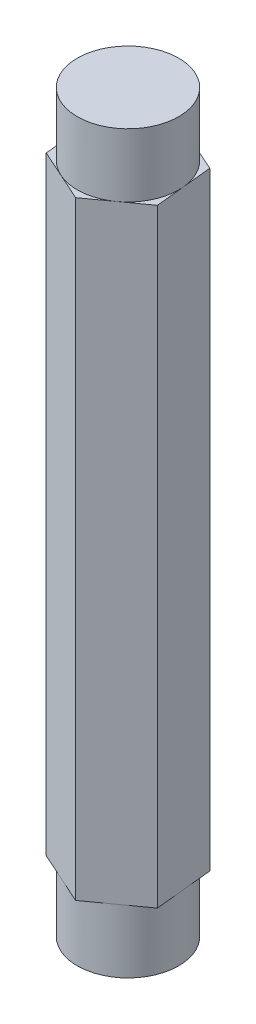
ISO-10303-21;
HEADER;
FILE_DESCRIPTION(('STEP AP214'),'2;1');
FILE_NAME('part.step','',(''),(''),'','','');
FILE_SCHEMA(('AUTOMOTIVE_DESIGN { 1 0 10303 214 1 1 1 1 }'));
ENDSEC;
DATA;
#1=APPLICATION_CONTEXT('core data for automotive mechanical design processes');
#2=APPLICATION_PROTOCOL_DEFINITION('international standard','automotive_design',2000,#1);
#3=PRODUCT_CONTEXT('',#1,'mechanical');
#4=PRODUCT('Part','Part','',(#3));
#5=PRODUCT_RELATED_PRODUCT_CATEGORY('part','',(#4));
#6=PRODUCT_DEFINITION_FORMATION('','',#4);
#7=PRODUCT_DEFINITION_CONTEXT('part definition',#1,'design');
#8=PRODUCT_DEFINITION('design','',#6,#7);
#9=PRODUCT_DEFINITION_SHAPE('','',#8);
#10=(LENGTH_UNIT() NAMED_UNIT(*) SI_UNIT(.MILLI.,.METRE.));
#11=(NAMED_UNIT(*) PLANE_ANGLE_UNIT() SI_UNIT($,.RADIAN.));
#12=(NAMED_UNIT(*) SI_UNIT($,.STERADIAN.) SOLID_ANGLE_UNIT());
#13=UNCERTAINTY_MEASURE_WITH_UNIT(LENGTH_MEASURE(1.E-05),#10,'distance_accuracy_value','');
#14=(GEOMETRIC_REPRESENTATION_CONTEXT(3) GLOBAL_UNCERTAINTY_ASSIGNED_CONTEXT((#13)) GLOBAL_UNIT_ASSIGNED_CONTEXT((#10,
#11,#12)) REPRESENTATION_CONTEXT('',''));
#15=CARTESIAN_POINT('',(0.,0.,0.));
#16=DIRECTION('',(0.,0.,1.));
#17=DIRECTION('',(1.,0.,0.));
#18=AXIS2_PLACEMENT_3D('',#15,#16,#17);
#19=CARTESIAN_POINT('',(0.,76.2,0.));
#20=DIRECTION('',(0.,1.,0.));
#21=DIRECTION('',(0.,0.,1.));
#22=AXIS2_PLACEMENT_3D('',#19,#20,#21);
#23=PLANE('',#22);
#24=CARTESIAN_POINT('',(0.,76.2,0.));
#25=DIRECTION('',(0.,1.,0.));
#26=DIRECTION('',(0.,0.,1.));
#27=AXIS2_PLACEMENT_3D('',#24,#25,#26);
#28=CIRCLE('',#27,6.35);
#29=CARTESIAN_POINT('',(3.71233056457002,76.2,5.15180568144406));
#30=VERTEX_POINT('',#29);
#31=CARTESIAN_POINT('',(6.31775987777654,76.2,-0.639069735441033));
#32=VERTEX_POINT('',#31);
#33=EDGE_CURVE('E44',#30,#32,#28,.T.);
#34=ORIENTED_EDGE('',*,*,#33,.F.);
#35=DIRECTION('',(0.811307981329773,0.,-0.584618986546459));
#36=VECTOR('',#35,1.);
#37=CARTESIAN_POINT('',(0.737934167575647,76.2,7.29512073221941));
#38=LINE('',#37,#36);
#39=CARTESIAN_POINT('',(6.68672696156437,76.2,3.00849063066868));
#40=VERTEX_POINT('',#39);
#41=EDGE_CURVE('E132',#30,#40,#38,.T.);
#42=ORIENTED_EDGE('',*,*,#41,.T.);
#43=DIRECTION('',(-0.100640903219061,0.,-0.994922815397884));
#44=VECTOR('',#43,1.);
#45=CARTESIAN_POINT('',(6.68672696156437,76.2,3.00849063066868));
#46=LINE('',#45,#44);
#47=EDGE_CURVE('E144',#40,#32,#46,.T.);
#48=ORIENTED_EDGE('',*,*,#47,.T.);
#49=EDGE_LOOP('',(#34,#42,#48));
#50=FACE_BOUND('',#49,.T.);
#51=ADVANCED_FACE('F33',(#50),#23,.T.);
#52=CARTESIAN_POINT('',(2.60542931320654,76.2,-5.79087541688507));
#53=VERTEX_POINT('',#52);
#54=EDGE_CURVE('E11',#32,#53,#28,.T.);
#55=ORIENTED_EDGE('',*,*,#54,.F.);
#56=CARTESIAN_POINT('',(5.94879279398872,76.2,-4.28663010155074));
#57=VERTEX_POINT('',#56);
#58=EDGE_CURVE('E165',#32,#57,#46,.T.);
#59=ORIENTED_EDGE('',*,*,#58,.T.);
#60=DIRECTION('',(-0.911948884548833,0.,-0.410303828851424));
#61=VECTOR('',#60,1.);
#62=CARTESIAN_POINT('',(5.94879279398872,76.2,-4.28663010155074));
#63=LINE('',#62,#61);
#64=EDGE_CURVE('E166',#57,#53,#63,.T.);
#65=ORIENTED_EDGE('',*,*,#64,.T.);
#66=EDGE_LOOP('',(#55,#59,#65));
#67=FACE_BOUND('',#66,.T.);
#68=ADVANCED_FACE('F261',(#67),#23,.T.);
#69=CARTESIAN_POINT('',(-3.71233056457001,76.2,-5.15180568144404));
#70=VERTEX_POINT('',#69);
#71=EDGE_CURVE('E42',#53,#70,#28,.T.);
#72=ORIENTED_EDGE('',*,*,#71,.F.);
#73=CARTESIAN_POINT('',(-0.737934167575646,76.2,-7.29512073221941));
#74=VERTEX_POINT('',#73);
#75=EDGE_CURVE('E164',#53,#74,#63,.T.);
#76=ORIENTED_EDGE('',*,*,#75,.T.);
#77=DIRECTION('',(-0.811307981329773,0.,0.584618986546459));
#78=VECTOR('',#77,1.);
#79=CARTESIAN_POINT('',(-0.737934167575646,76.2,-7.29512073221941));
#80=LINE('',#79,#78);
#81=EDGE_CURVE('E170',#74,#70,#80,.T.);
#82=ORIENTED_EDGE('',*,*,#81,.T.);
#83=EDGE_LOOP('',(#72,#76,#82));
#84=FACE_BOUND('',#83,.T.);
#85=ADVANCED_FACE('F265',(#84),#23,.T.);
#86=CARTESIAN_POINT('',(-6.31775987777654,76.2,0.639069735441035));
#87=VERTEX_POINT('',#86);
#88=EDGE_CURVE('E150',#70,#87,#28,.T.);
#89=ORIENTED_EDGE('',*,*,#88,.F.);
#90=CARTESIAN_POINT('',(-6.68672696156436,76.2,-3.00849063066868));
#91=VERTEX_POINT('',#90);
#92=EDGE_CURVE('E169',#70,#91,#80,.T.);
#93=ORIENTED_EDGE('',*,*,#92,.T.);
#94=DIRECTION('',(0.100640903219061,0.,0.994922815397884));
#95=VECTOR('',#94,1.);
#96=CARTESIAN_POINT('',(-6.68672696156436,76.2,-3.00849063066868));
#97=LINE('',#96,#95);
#98=EDGE_CURVE('E174',#91,#87,#97,.T.);
#99=ORIENTED_EDGE('',*,*,#98,.T.);
#100=EDGE_LOOP('',(#89,#93,#99));
#101=FACE_BOUND('',#100,.T.);
#102=ADVANCED_FACE('F269',(#101),#23,.T.);
#103=CARTESIAN_POINT('',(-2.60542931320654,76.2,5.79087541688508));
#104=VERTEX_POINT('',#103);
#105=EDGE_CURVE('E59',#87,#104,#28,.T.);
#106=ORIENTED_EDGE('',*,*,#105,.F.);
#107=CARTESIAN_POINT('',(-5.94879279398871,76.2,4.28663010155075));
#108=VERTEX_POINT('',#107);
#109=EDGE_CURVE('E173',#87,#108,#97,.T.);
#110=ORIENTED_EDGE('',*,*,#109,.T.);
#111=DIRECTION('',(0.911948884548833,0.,0.410303828851424));
#112=VECTOR('',#111,1.);
#113=CARTESIAN_POINT('',(-5.94879279398871,76.2,4.28663010155075));
#114=LINE('',#113,#112);
#115=EDGE_CURVE('E142',#108,#104,#114,.T.);
#116=ORIENTED_EDGE('',*,*,#115,.T.);
#117=EDGE_LOOP('',(#106,#110,#116));
#118=FACE_BOUND('',#117,.T.);
#119=ADVANCED_FACE('F270',(#118),#23,.T.);
#120=CARTESIAN_POINT('',(0.,0.,0.));
#121=DIRECTION('',(0.,1.,0.));
#122=DIRECTION('',(0.,0.,1.));
#123=AXIS2_PLACEMENT_3D('',#120,#121,#122);
#124=PLANE('',#123);
#125=CARTESIAN_POINT('',(0.,0.,0.));
#126=DIRECTION('',(0.,-1.,0.));
#127=DIRECTION('',(0.,0.,-1.));
#128=AXIS2_PLACEMENT_3D('',#125,#126,#127);
#129=CIRCLE('',#128,6.35);
#130=CARTESIAN_POINT('',(2.60542931320655,0.,-5.79087541688509));
#131=VERTEX_POINT('',#130);
#132=CARTESIAN_POINT('',(6.31775987777654,0.,-0.639069735441033));
#133=VERTEX_POINT('',#132);
#134=EDGE_CURVE('E154',#131,#133,#129,.T.);
#135=ORIENTED_EDGE('',*,*,#134,.F.);
#136=DIRECTION('',(-0.911948884548833,0.,-0.410303828851424));
#137=VECTOR('',#136,1.);
#138=CARTESIAN_POINT('',(5.94879279398872,0.,-4.28663010155074));
#139=LINE('',#138,#137);
#140=CARTESIAN_POINT('',(5.94879279398872,0.,-4.28663010155074));
#141=VERTEX_POINT('',#140);
#142=EDGE_CURVE('E182',#141,#131,#139,.T.);
#143=ORIENTED_EDGE('',*,*,#142,.F.);
#144=DIRECTION('',(-0.100640903219061,0.,-0.994922815397884));
#145=VECTOR('',#144,1.);
#146=CARTESIAN_POINT('',(6.68672696156437,0.,3.00849063066868));
#147=LINE('',#146,#145);
#148=EDGE_CURVE('E159',#133,#141,#147,.T.);
#149=ORIENTED_EDGE('',*,*,#148,.F.);
#150=EDGE_LOOP('',(#135,#143,#149));
#151=FACE_BOUND('',#150,.T.);
#152=ADVANCED_FACE('F257',(#151),#124,.F.);
#153=CARTESIAN_POINT('',(3.71233056457001,0.,5.15180568144405));
#154=VERTEX_POINT('',#153);
#155=EDGE_CURVE('E149',#133,#154,#129,.T.);
#156=ORIENTED_EDGE('',*,*,#155,.F.);
#157=CARTESIAN_POINT('',(6.68672696156437,0.,3.00849063066868));
#158=VERTEX_POINT('',#157);
#159=EDGE_CURVE('E178',#158,#133,#147,.T.);
#160=ORIENTED_EDGE('',*,*,#159,.F.);
#161=DIRECTION('',(0.811307981329773,0.,-0.584618986546459));
#162=VECTOR('',#161,1.);
#163=CARTESIAN_POINT('',(0.737934167575647,0.,7.29512073221941));
#164=LINE('',#163,#162);
#165=EDGE_CURVE('E196',#154,#158,#164,.T.);
#166=ORIENTED_EDGE('',*,*,#165,.F.);
#167=EDGE_LOOP('',(#156,#160,#166));
#168=FACE_BOUND('',#167,.T.);
#169=ADVANCED_FACE('F232',(#168),#124,.F.);
#170=CARTESIAN_POINT('',(-2.60542931320654,0.,5.79087541688508));
#171=VERTEX_POINT('',#170);
#172=EDGE_CURVE('E152',#154,#171,#129,.T.);
#173=ORIENTED_EDGE('',*,*,#172,.F.);
#174=CARTESIAN_POINT('',(0.737934167575647,0.,7.29512073221941));
#175=VERTEX_POINT('',#174);
#176=EDGE_CURVE('E197',#175,#154,#164,.T.);
#177=ORIENTED_EDGE('',*,*,#176,.F.);
#178=DIRECTION('',(0.911948884548833,0.,0.410303828851424));
#179=VECTOR('',#178,1.);
#180=CARTESIAN_POINT('',(-5.94879279398871,0.,4.28663010155075));
#181=LINE('',#180,#179);
#182=EDGE_CURVE('E192',#171,#175,#181,.T.);
#183=ORIENTED_EDGE('',*,*,#182,.F.);
#184=EDGE_LOOP('',(#173,#177,#183));
#185=FACE_BOUND('',#184,.T.);
#186=ADVANCED_FACE('F229',(#185),#124,.F.);
#187=CARTESIAN_POINT('',(-6.31775987777654,0.,0.639069735441035));
#188=VERTEX_POINT('',#187);
#189=EDGE_CURVE('E221',#171,#188,#129,.T.);
#190=ORIENTED_EDGE('',*,*,#189,.F.);
#191=CARTESIAN_POINT('',(-5.94879279398871,0.,4.28663010155075));
#192=VERTEX_POINT('',#191);
#193=EDGE_CURVE('E193',#192,#171,#181,.T.);
#194=ORIENTED_EDGE('',*,*,#193,.F.);
#195=DIRECTION('',(0.100640903219061,0.,0.994922815397884));
#196=VECTOR('',#195,1.);
#197=CARTESIAN_POINT('',(-6.68672696156436,0.,-3.00849063066868));
#198=LINE('',#197,#196);
#199=EDGE_CURVE('E188',#188,#192,#198,.T.);
#200=ORIENTED_EDGE('',*,*,#199,.F.);
#201=EDGE_LOOP('',(#190,#194,#200));
#202=FACE_BOUND('',#201,.T.);
#203=ADVANCED_FACE('F241',(#202),#124,.F.);
#204=CARTESIAN_POINT('',(-3.71233056457001,0.,-5.15180568144404));
#205=VERTEX_POINT('',#204);
#206=EDGE_CURVE('E218',#188,#205,#129,.T.);
#207=ORIENTED_EDGE('',*,*,#206,.F.);
#208=CARTESIAN_POINT('',(-6.68672696156436,0.,-3.00849063066868));
#209=VERTEX_POINT('',#208);
#210=EDGE_CURVE('E189',#209,#188,#198,.T.);
#211=ORIENTED_EDGE('',*,*,#210,.F.);
#212=DIRECTION('',(-0.811307981329773,0.,0.584618986546459));
#213=VECTOR('',#212,1.);
#214=CARTESIAN_POINT('',(-0.737934167575646,0.,-7.29512073221941));
#215=LINE('',#214,#213);
#216=EDGE_CURVE('E184',#205,#209,#215,.T.);
#217=ORIENTED_EDGE('',*,*,#216,.F.);
#218=EDGE_LOOP('',(#207,#211,#217));
#219=FACE_BOUND('',#218,.T.);
#220=ADVANCED_FACE('F249',(#219),#124,.F.);
#221=CARTESIAN_POINT('',(6.68672696156437,76.2,3.00849063066868));
#222=DIRECTION('',(-0.994922815397884,0.,0.100640903219061));
#223=DIRECTION('',(0.100640903219061,0.,0.994922815397884));
#224=AXIS2_PLACEMENT_3D('',#221,#222,#223);
#225=PLANE('',#224);
#226=ORIENTED_EDGE('',*,*,#159,.T.);
#227=ORIENTED_EDGE('',*,*,#148,.T.);
#228=DIRECTION('',(0.,-1.,0.));
#229=VECTOR('',#228,1.);
#230=CARTESIAN_POINT('',(5.94879279398872,76.2,-4.28663010155074));
#231=LINE('',#230,#229);
#232=EDGE_CURVE('E37',#57,#141,#231,.T.);
#233=ORIENTED_EDGE('',*,*,#232,.F.);
#234=ORIENTED_EDGE('',*,*,#58,.F.);
#235=ORIENTED_EDGE('',*,*,#47,.F.);
#236=DIRECTION('',(0.,-1.,0.));
#237=VECTOR('',#236,1.);
#238=CARTESIAN_POINT('',(6.68672696156437,76.2,3.00849063066868));
#239=LINE('',#238,#237);
#240=EDGE_CURVE('E131',#40,#158,#239,.T.);
#241=ORIENTED_EDGE('',*,*,#240,.T.);
#242=EDGE_LOOP('',(#226,#227,#233,#234,#235,#241));
#243=FACE_BOUND('',#242,.T.);
#244=ADVANCED_FACE('F35',(#243),#225,.F.);
#245=CARTESIAN_POINT('',(5.94879279398872,76.2,-4.28663010155074));
#246=DIRECTION('',(-0.410303828851425,0.,0.911948884548833));
#247=DIRECTION('',(0.911948884548833,0.,0.410303828851425));
#248=AXIS2_PLACEMENT_3D('',#245,#246,#247);
#249=PLANE('',#248);
#250=ORIENTED_EDGE('',*,*,#142,.T.);
#251=CARTESIAN_POINT('',(-0.737934167575646,0.,-7.29512073221941));
#252=VERTEX_POINT('',#251);
#253=EDGE_CURVE('E181',#131,#252,#139,.T.);
#254=ORIENTED_EDGE('',*,*,#253,.T.);
#255=DIRECTION('',(0.,-1.,0.));
#256=VECTOR('',#255,1.);
#257=CARTESIAN_POINT('',(-0.737934167575646,76.2,-7.29512073221941));
#258=LINE('',#257,#256);
#259=EDGE_CURVE('E207',#74,#252,#258,.T.);
#260=ORIENTED_EDGE('',*,*,#259,.F.);
#261=ORIENTED_EDGE('',*,*,#75,.F.);
#262=ORIENTED_EDGE('',*,*,#64,.F.);
#263=ORIENTED_EDGE('',*,*,#232,.T.);
#264=EDGE_LOOP('',(#250,#254,#260,#261,#262,#263));
#265=FACE_BOUND('',#264,.T.);
#266=ADVANCED_FACE('F263',(#265),#249,.F.);
#267=CARTESIAN_POINT('',(-0.737934167575646,76.2,-7.29512073221941));
#268=DIRECTION('',(0.584618986546459,0.,0.811307981329773));
#269=DIRECTION('',(0.811307981329773,0.,-0.584618986546459));
#270=AXIS2_PLACEMENT_3D('',#267,#268,#269);
#271=PLANE('',#270);
#272=EDGE_CURVE('E185',#252,#205,#215,.T.);
#273=ORIENTED_EDGE('',*,*,#272,.T.);
#274=ORIENTED_EDGE('',*,*,#216,.T.);
#275=DIRECTION('',(0.,-1.,0.));
#276=VECTOR('',#275,1.);
#277=CARTESIAN_POINT('',(-6.68672696156436,76.2,-3.00849063066868));
#278=LINE('',#277,#276);
#279=EDGE_CURVE('E205',#91,#209,#278,.T.);
#280=ORIENTED_EDGE('',*,*,#279,.F.);
#281=ORIENTED_EDGE('',*,*,#92,.F.);
#282=ORIENTED_EDGE('',*,*,#81,.F.);
#283=ORIENTED_EDGE('',*,*,#259,.T.);
#284=EDGE_LOOP('',(#273,#274,#280,#281,#282,#283));
#285=FACE_BOUND('',#284,.T.);
#286=ADVANCED_FACE('F250',(#285),#271,.F.);
#287=CARTESIAN_POINT('',(-6.68672696156436,76.2,-3.00849063066868));
#288=DIRECTION('',(0.994922815397884,0.,-0.100640903219061));
#289=DIRECTION('',(-0.100640903219061,0.,-0.994922815397884));
#290=AXIS2_PLACEMENT_3D('',#287,#288,#289);
#291=PLANE('',#290);
#292=ORIENTED_EDGE('',*,*,#210,.T.);
#293=ORIENTED_EDGE('',*,*,#199,.T.);
#294=DIRECTION('',(0.,-1.,0.));
#295=VECTOR('',#294,1.);
#296=CARTESIAN_POINT('',(-5.94879279398871,76.2,4.28663010155075));
#297=LINE('',#296,#295);
#298=EDGE_CURVE('E202',#108,#192,#297,.T.);
#299=ORIENTED_EDGE('',*,*,#298,.F.);
#300=ORIENTED_EDGE('',*,*,#109,.F.);
#301=ORIENTED_EDGE('',*,*,#98,.F.);
#302=ORIENTED_EDGE('',*,*,#279,.T.);
#303=EDGE_LOOP('',(#292,#293,#299,#300,#301,#302));
#304=FACE_BOUND('',#303,.T.);
#305=ADVANCED_FACE('F244',(#304),#291,.F.);
#306=CARTESIAN_POINT('',(-5.94879279398871,76.2,4.28663010155075));
#307=DIRECTION('',(0.410303828851424,0.,-0.911948884548833));
#308=DIRECTION('',(-0.911948884548833,0.,-0.410303828851424));
#309=AXIS2_PLACEMENT_3D('',#306,#307,#308);
#310=PLANE('',#309);
#311=ORIENTED_EDGE('',*,*,#193,.T.);
#312=ORIENTED_EDGE('',*,*,#182,.T.);
#313=DIRECTION('',(0.,-1.,0.));
#314=VECTOR('',#313,1.);
#315=CARTESIAN_POINT('',(0.737934167575647,76.2,7.29512073221941));
#316=LINE('',#315,#314);
#317=CARTESIAN_POINT('',(0.737934167575647,76.2,7.29512073221941));
#318=VERTEX_POINT('',#317);
#319=EDGE_CURVE('E200',#318,#175,#316,.T.);
#320=ORIENTED_EDGE('',*,*,#319,.F.);
#321=EDGE_CURVE('E127',#104,#318,#114,.T.);
#322=ORIENTED_EDGE('',*,*,#321,.F.);
#323=ORIENTED_EDGE('',*,*,#115,.F.);
#324=ORIENTED_EDGE('',*,*,#298,.T.);
#325=EDGE_LOOP('',(#311,#312,#320,#322,#323,#324));
#326=FACE_BOUND('',#325,.T.);
#327=ADVANCED_FACE('F235',(#326),#310,.F.);
#328=CARTESIAN_POINT('',(0.737934167575647,76.2,7.29512073221941));
#329=DIRECTION('',(-0.584618986546459,0.,-0.811307981329773));
#330=DIRECTION('',(-0.811307981329773,0.,0.584618986546459));
#331=AXIS2_PLACEMENT_3D('',#328,#329,#330);
#332=PLANE('',#331);
#333=ORIENTED_EDGE('',*,*,#176,.T.);
#334=ORIENTED_EDGE('',*,*,#165,.T.);
#335=ORIENTED_EDGE('',*,*,#240,.F.);
#336=ORIENTED_EDGE('',*,*,#41,.F.);
#337=EDGE_CURVE('E124',#318,#30,#38,.T.);
#338=ORIENTED_EDGE('',*,*,#337,.F.);
#339=ORIENTED_EDGE('',*,*,#319,.T.);
#340=EDGE_LOOP('',(#333,#334,#335,#336,#338,#339));
#341=FACE_BOUND('',#340,.T.);
#342=ADVANCED_FACE('F137',(#341),#332,.F.);
#343=EDGE_CURVE('E51',#104,#30,#28,.T.);
#344=ORIENTED_EDGE('',*,*,#343,.F.);
#345=ORIENTED_EDGE('',*,*,#321,.T.);
#346=ORIENTED_EDGE('',*,*,#337,.T.);
#347=EDGE_LOOP('',(#344,#345,#346));
#348=FACE_BOUND('',#347,.T.);
#349=ADVANCED_FACE('F126',(#348),#23,.T.);
#350=EDGE_CURVE('E162',#205,#131,#129,.T.);
#351=ORIENTED_EDGE('',*,*,#350,.F.);
#352=ORIENTED_EDGE('',*,*,#272,.F.);
#353=ORIENTED_EDGE('',*,*,#253,.F.);
#354=EDGE_LOOP('',(#351,#352,#353));
#355=FACE_BOUND('',#354,.T.);
#356=ADVANCED_FACE('F253',(#355),#124,.F.);
#357=CARTESIAN_POINT('',(0.,-7.9375,0.));
#358=DIRECTION('',(0.,1.,0.));
#359=DIRECTION('',(0.,0.,1.));
#360=AXIS2_PLACEMENT_3D('',#357,#358,#359);
#361=CYLINDRICAL_SURFACE('',#360,6.35);
#362=CARTESIAN_POINT('',(0.,-7.9375,0.));
#363=DIRECTION('',(0.,-1.,0.));
#364=DIRECTION('',(0.,0.,-1.));
#365=AXIS2_PLACEMENT_3D('',#362,#363,#364);
#366=CIRCLE('',#365,6.35);
#367=CARTESIAN_POINT('',(0.,-7.9375,-6.35));
#368=VERTEX_POINT('',#367);
#369=EDGE_CURVE('E157',#368,#368,#366,.T.);
#370=ORIENTED_EDGE('',*,*,#369,.F.);
#371=EDGE_LOOP('',(#370));
#372=FACE_BOUND('',#371,.T.);
#373=ORIENTED_EDGE('',*,*,#134,.T.);
#374=ORIENTED_EDGE('',*,*,#155,.T.);
#375=ORIENTED_EDGE('',*,*,#172,.T.);
#376=ORIENTED_EDGE('',*,*,#189,.T.);
#377=ORIENTED_EDGE('',*,*,#206,.T.);
#378=ORIENTED_EDGE('',*,*,#350,.T.);
#379=EDGE_LOOP('',(#373,#374,#375,#376,#377,#378));
#380=FACE_BOUND('',#379,.T.);
#381=ADVANCED_FACE('F224',(#372,#380),#361,.T.);
#382=CARTESIAN_POINT('',(0.,-7.9375,0.));
#383=DIRECTION('',(0.,-1.,0.));
#384=DIRECTION('',(0.,0.,-1.));
#385=AXIS2_PLACEMENT_3D('',#382,#383,#384);
#386=PLANE('',#385);
#387=ORIENTED_EDGE('',*,*,#369,.T.);
#388=EDGE_LOOP('',(#387));
#389=FACE_BOUND('',#388,.T.);
#390=ADVANCED_FACE('F363',(#389),#386,.T.);
#391=CARTESIAN_POINT('',(0.,84.1375,0.));
#392=DIRECTION('',(0.,-1.,0.));
#393=DIRECTION('',(0.,0.,-1.));
#394=AXIS2_PLACEMENT_3D('',#391,#392,#393);
#395=CYLINDRICAL_SURFACE('',#394,6.35);
#396=CARTESIAN_POINT('',(0.,84.1375,0.));
#397=DIRECTION('',(0.,1.,0.));
#398=DIRECTION('',(0.,0.,1.));
#399=AXIS2_PLACEMENT_3D('',#396,#397,#398);
#400=CIRCLE('',#399,6.35);
#401=CARTESIAN_POINT('',(0.,84.1375,6.35));
#402=VERTEX_POINT('',#401);
#403=EDGE_CURVE('E146',#402,#402,#400,.T.);
#404=ORIENTED_EDGE('',*,*,#403,.F.);
#405=EDGE_LOOP('',(#404));
#406=FACE_BOUND('',#405,.T.);
#407=ORIENTED_EDGE('',*,*,#33,.T.);
#408=ORIENTED_EDGE('',*,*,#54,.T.);
#409=ORIENTED_EDGE('',*,*,#71,.T.);
#410=ORIENTED_EDGE('',*,*,#88,.T.);
#411=ORIENTED_EDGE('',*,*,#105,.T.);
#412=ORIENTED_EDGE('',*,*,#343,.T.);
#413=EDGE_LOOP('',(#407,#408,#409,#410,#411,#412));
#414=FACE_BOUND('',#413,.T.);
#415=ADVANCED_FACE('F147',(#406,#414),#395,.T.);
#416=CARTESIAN_POINT('',(0.,84.1375,0.));
#417=DIRECTION('',(0.,1.,0.));
#418=DIRECTION('',(0.,0.,1.));
#419=AXIS2_PLACEMENT_3D('',#416,#417,#418);
#420=PLANE('',#419);
#421=ORIENTED_EDGE('',*,*,#403,.T.);
#422=EDGE_LOOP('',(#421));
#423=FACE_BOUND('',#422,.T.);
#424=ADVANCED_FACE('F362',(#423),#420,.T.);
#425=CLOSED_SHELL('',(#51,#68,#85,#102,#119,#152,#169,#186,#203,#220,#244,#266,#286,#305,#327,
#342,#349,#356,#381,#390,#415,#424));
#426=MANIFOLD_SOLID_BREP('B2',#425);
#427=ADVANCED_BREP_SHAPE_REPRESENTATION('',(#18,#426),#14);
#428=SHAPE_DEFINITION_REPRESENTATION(#9,#427);
ENDSEC;
END-ISO-10303-21;
